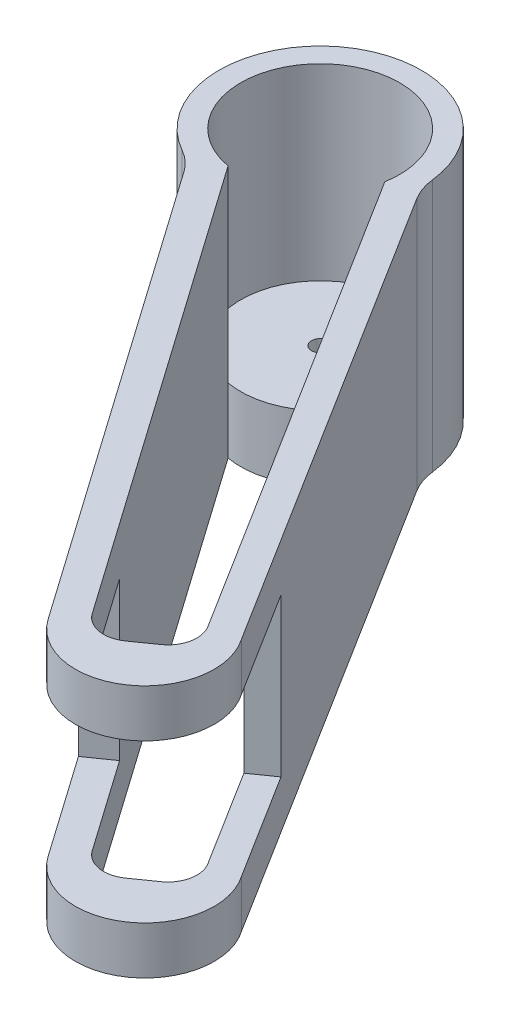
ISO-10303-21;
HEADER;
FILE_DESCRIPTION(('STEP AP214'),'2;1');
FILE_NAME('part.step','',(''),(''),'','','');
FILE_SCHEMA(('AUTOMOTIVE_DESIGN { 1 0 10303 214 1 1 1 1 }'));
ENDSEC;
DATA;
#1=APPLICATION_CONTEXT('core data for automotive mechanical design processes');
#2=APPLICATION_PROTOCOL_DEFINITION('international standard','automotive_design',2000,#1);
#3=PRODUCT_CONTEXT('',#1,'mechanical');
#4=PRODUCT('Part','Part','',(#3));
#5=PRODUCT_RELATED_PRODUCT_CATEGORY('part','',(#4));
#6=PRODUCT_DEFINITION_FORMATION('','',#4);
#7=PRODUCT_DEFINITION_CONTEXT('part definition',#1,'design');
#8=PRODUCT_DEFINITION('design','',#6,#7);
#9=PRODUCT_DEFINITION_SHAPE('','',#8);
#10=(LENGTH_UNIT() NAMED_UNIT(*) SI_UNIT(.MILLI.,.METRE.));
#11=(NAMED_UNIT(*) PLANE_ANGLE_UNIT() SI_UNIT($,.RADIAN.));
#12=(NAMED_UNIT(*) SI_UNIT($,.STERADIAN.) SOLID_ANGLE_UNIT());
#13=UNCERTAINTY_MEASURE_WITH_UNIT(LENGTH_MEASURE(1.E-05),#10,'distance_accuracy_value','');
#14=(GEOMETRIC_REPRESENTATION_CONTEXT(3) GLOBAL_UNCERTAINTY_ASSIGNED_CONTEXT((#13)) GLOBAL_UNIT_ASSIGNED_CONTEXT((#10,
#11,#12)) REPRESENTATION_CONTEXT('',''));
#15=CARTESIAN_POINT('',(0.,0.,0.));
#16=DIRECTION('',(0.,0.,1.));
#17=DIRECTION('',(1.,0.,0.));
#18=AXIS2_PLACEMENT_3D('',#15,#16,#17);
#19=CARTESIAN_POINT('',(60.7407268220711,44.45,91.5421301493623));
#20=DIRECTION('',(0.,-1.,0.));
#21=DIRECTION('',(0.,0.,-1.));
#22=AXIS2_PLACEMENT_3D('',#19,#20,#21);
#23=CYLINDRICAL_SURFACE('',#22,12.2007937034501);
#24=DIRECTION('',(0.,-1.,0.));
#25=VECTOR('',#24,1.);
#26=CARTESIAN_POINT('',(50.7538789821845,44.45,98.5508559406242));
#27=LINE('',#26,#25);
#28=CARTESIAN_POINT('',(50.7538789821845,44.45,98.5508559406242));
#29=VERTEX_POINT('',#28);
#30=CARTESIAN_POINT('',(50.7538789821845,36.068,98.5508559406242));
#31=VERTEX_POINT('',#30);
#32=EDGE_CURVE('E349',#29,#31,#27,.T.);
#33=ORIENTED_EDGE('',*,*,#32,.T.);
#34=CARTESIAN_POINT('',(60.7407268220711,36.068,91.5421301493623));
#35=DIRECTION('',(0.,1.,0.));
#36=DIRECTION('',(0.,0.,1.));
#37=AXIS2_PLACEMENT_3D('',#34,#35,#36);
#38=CIRCLE('',#37,12.2007937034501);
#39=CARTESIAN_POINT('',(70.7275746619577,36.068,84.5334043581003));
#40=VERTEX_POINT('',#39);
#41=EDGE_CURVE('E235',#31,#40,#38,.T.);
#42=ORIENTED_EDGE('',*,*,#41,.T.);
#43=DIRECTION('',(0.,-1.,0.));
#44=VECTOR('',#43,1.);
#45=CARTESIAN_POINT('',(70.7275746619577,44.45,84.5334043581003));
#46=LINE('',#45,#44);
#47=CARTESIAN_POINT('',(70.7275746619577,44.45,84.5334043581003));
#48=VERTEX_POINT('',#47);
#49=EDGE_CURVE('E345',#48,#40,#46,.T.);
#50=ORIENTED_EDGE('',*,*,#49,.F.);
#51=CARTESIAN_POINT('',(60.7407268220711,44.45,91.5421301493623));
#52=DIRECTION('',(0.,1.,0.));
#53=DIRECTION('',(0.,0.,1.));
#54=AXIS2_PLACEMENT_3D('',#51,#52,#53);
#55=CIRCLE('',#54,12.2007937034501);
#56=EDGE_CURVE('E314',#29,#48,#55,.T.);
#57=ORIENTED_EDGE('',*,*,#56,.F.);
#58=EDGE_LOOP('',(#33,#42,#50,#57));
#59=FACE_BOUND('',#58,.T.);
#60=ADVANCED_FACE('F32',(#59),#23,.T.);
#61=CARTESIAN_POINT('',(61.5820834142253,0.,88.3099991967454));
#62=DIRECTION('',(0.,1.,0.));
#63=DIRECTION('',(0.,0.,1.));
#64=AXIS2_PLACEMENT_3D('',#61,#62,#63);
#65=CYLINDRICAL_SURFACE('',#64,5.08);
#66=DIRECTION('',(0.,1.,0.));
#67=VECTOR('',#66,1.);
#68=CARTESIAN_POINT('',(65.887093564735,0.,85.6130958606934));
#69=LINE('',#68,#67);
#70=CARTESIAN_POINT('',(65.887093564735,36.068,85.6130958606934));
#71=VERTEX_POINT('',#70);
#72=CARTESIAN_POINT('',(65.887093564735,44.45,85.6130958606934));
#73=VERTEX_POINT('',#72);
#74=EDGE_CURVE('E279',#71,#73,#69,.T.);
#75=ORIENTED_EDGE('',*,*,#74,.F.);
#76=CARTESIAN_POINT('',(61.5820834142253,36.068,88.3099991967454));
#77=DIRECTION('',(0.,1.,0.));
#78=DIRECTION('',(0.,0.,1.));
#79=AXIS2_PLACEMENT_3D('',#76,#77,#78);
#80=CIRCLE('',#79,5.08);
#81=CARTESIAN_POINT('',(64.5005975608474,36.068,92.4679644654756));
#82=VERTEX_POINT('',#81);
#83=EDGE_CURVE('E227',#71,#82,#80,.F.);
#84=ORIENTED_EDGE('',*,*,#83,.T.);
#85=DIRECTION('',(0.,1.,0.));
#86=VECTOR('',#85,1.);
#87=CARTESIAN_POINT('',(64.5005975608474,0.,92.4679644654756));
#88=LINE('',#87,#86);
#89=CARTESIAN_POINT('',(64.5005975608474,44.45,92.4679644654756));
#90=VERTEX_POINT('',#89);
#91=EDGE_CURVE('E283',#82,#90,#88,.T.);
#92=ORIENTED_EDGE('',*,*,#91,.T.);
#93=CARTESIAN_POINT('',(61.5820834142253,44.45,88.3099991967454));
#94=DIRECTION('',(0.,1.,0.));
#95=DIRECTION('',(0.,0.,1.));
#96=AXIS2_PLACEMENT_3D('',#93,#94,#95);
#97=CIRCLE('',#96,5.08);
#98=EDGE_CURVE('E270',#90,#73,#97,.T.);
#99=ORIENTED_EDGE('',*,*,#98,.T.);
#100=EDGE_LOOP('',(#75,#84,#92,#99));
#101=FACE_BOUND('',#100,.T.);
#102=ADVANCED_FACE('F403',(#101),#65,.F.);
#103=CARTESIAN_POINT('',(64.5005975608474,0.,92.4679644654756));
#104=DIRECTION('',(0.574510658783885,0.,0.818497100143737));
#105=DIRECTION('',(0.818497100143737,0.,-0.574510658783885));
#106=AXIS2_PLACEMENT_3D('',#103,#104,#105);
#107=PLANE('',#106);
#108=ORIENTED_EDGE('',*,*,#91,.F.);
#109=DIRECTION('',(-0.818497100143737,0.,0.574510658783885));
#110=VECTOR('',#109,1.);
#111=CARTESIAN_POINT('',(64.5005975608474,36.068,92.4679644654756));
#112=LINE('',#111,#110);
#113=CARTESIAN_POINT('',(60.8378004128205,36.068,95.0389155441479));
#114=VERTEX_POINT('',#113);
#115=EDGE_CURVE('E224',#82,#114,#112,.T.);
#116=ORIENTED_EDGE('',*,*,#115,.T.);
#117=DIRECTION('',(0.,1.,0.));
#118=VECTOR('',#117,1.);
#119=CARTESIAN_POINT('',(60.8378004128205,0.,95.0389155441479));
#120=LINE('',#119,#118);
#121=CARTESIAN_POINT('',(60.8378004128205,44.45,95.0389155441479));
#122=VERTEX_POINT('',#121);
#123=EDGE_CURVE('E287',#114,#122,#120,.T.);
#124=ORIENTED_EDGE('',*,*,#123,.T.);
#125=DIRECTION('',(0.818497100143737,0.,-0.574510658783885));
#126=VECTOR('',#125,1.);
#127=CARTESIAN_POINT('',(64.5005975608474,44.45,92.4679644654756));
#128=LINE('',#127,#126);
#129=EDGE_CURVE('E267',#122,#90,#128,.T.);
#130=ORIENTED_EDGE('',*,*,#129,.T.);
#131=EDGE_LOOP('',(#108,#116,#124,#130));
#132=FACE_BOUND('',#131,.T.);
#133=ADVANCED_FACE('F400',(#132),#107,.F.);
#134=CARTESIAN_POINT('',(57.9192862661983,0.,90.8809502754177));
#135=DIRECTION('',(0.,1.,0.));
#136=DIRECTION('',(0.,0.,1.));
#137=AXIS2_PLACEMENT_3D('',#134,#135,#136);
#138=CYLINDRICAL_SURFACE('',#137,5.08);
#139=ORIENTED_EDGE('',*,*,#123,.F.);
#140=CARTESIAN_POINT('',(57.9192862661983,36.068,90.8809502754177));
#141=DIRECTION('',(0.,1.,0.));
#142=DIRECTION('',(0.,0.,1.));
#143=AXIS2_PLACEMENT_3D('',#140,#141,#142);
#144=CIRCLE('',#143,5.08);
#145=CARTESIAN_POINT('',(53.7613209974681,36.068,93.7994644220398));
#146=VERTEX_POINT('',#145);
#147=EDGE_CURVE('E221',#114,#146,#144,.F.);
#148=ORIENTED_EDGE('',*,*,#147,.T.);
#149=DIRECTION('',(0.,1.,0.));
#150=VECTOR('',#149,1.);
#151=CARTESIAN_POINT('',(53.7613209974681,0.,93.7994644220398));
#152=LINE('',#151,#150);
#153=CARTESIAN_POINT('',(53.7613209974681,44.45,93.7994644220398));
#154=VERTEX_POINT('',#153);
#155=EDGE_CURVE('E291',#146,#154,#152,.T.);
#156=ORIENTED_EDGE('',*,*,#155,.T.);
#157=CARTESIAN_POINT('',(57.9192862661983,44.45,90.8809502754177));
#158=DIRECTION('',(0.,1.,0.));
#159=DIRECTION('',(0.,0.,-1.));
#160=AXIS2_PLACEMENT_3D('',#157,#158,#159);
#161=CIRCLE('',#160,5.08);
#162=EDGE_CURVE('E264',#154,#122,#161,.T.);
#163=ORIENTED_EDGE('',*,*,#162,.T.);
#164=EDGE_LOOP('',(#139,#148,#156,#163));
#165=FACE_BOUND('',#164,.T.);
#166=ADVANCED_FACE('F394',(#165),#138,.F.);
#167=CARTESIAN_POINT('',(-13.7526976421414,44.45,24.3209150231614));
#168=DIRECTION('',(0.,-1.,0.));
#169=DIRECTION('',(0.,0.,-1.));
#170=AXIS2_PLACEMENT_3D('',#167,#168,#169);
#171=CYLINDRICAL_SURFACE('',#170,10.16);
#172=CARTESIAN_POINT('',(-13.7526976421414,0.,24.3209150231614));
#173=DIRECTION('',(0.,-1.,0.));
#174=DIRECTION('',(0.,0.,1.));
#175=AXIS2_PLACEMENT_3D('',#172,#173,#174);
#176=CIRCLE('',#175,10.16);
#177=CARTESIAN_POINT('',(-8.75171668136269,0.,15.47694592383));
#178=VERTEX_POINT('',#177);
#179=CARTESIAN_POINT('',(-5.43632278002439,0.,18.4845198041286));
#180=VERTEX_POINT('',#179);
#181=EDGE_CURVE('E304',#178,#180,#176,.T.);
#182=ORIENTED_EDGE('',*,*,#181,.T.);
#183=DIRECTION('',(0.,-1.,0.));
#184=VECTOR('',#183,1.);
#185=CARTESIAN_POINT('',(-5.43632278002439,44.45,18.4845198041286));
#186=LINE('',#185,#184);
#187=CARTESIAN_POINT('',(-5.43632278002439,44.45,18.4845198041286));
#188=VERTEX_POINT('',#187);
#189=EDGE_CURVE('E352',#188,#180,#186,.T.);
#190=ORIENTED_EDGE('',*,*,#189,.F.);
#191=CARTESIAN_POINT('',(-13.7526976421414,44.45,24.3209150231614));
#192=DIRECTION('',(0.,-1.,0.));
#193=DIRECTION('',(0.,0.,1.));
#194=AXIS2_PLACEMENT_3D('',#191,#192,#193);
#195=CIRCLE('',#194,10.16);
#196=CARTESIAN_POINT('',(-8.75171668136269,44.45,15.47694592383));
#197=VERTEX_POINT('',#196);
#198=EDGE_CURVE('E308',#197,#188,#195,.T.);
#199=ORIENTED_EDGE('',*,*,#198,.F.);
#200=DIRECTION('',(0.,-1.,0.));
#201=VECTOR('',#200,1.);
#202=CARTESIAN_POINT('',(-8.75171668136269,44.45,15.47694592383));
#203=LINE('',#202,#201);
#204=EDGE_CURVE('E322',#197,#178,#203,.T.);
#205=ORIENTED_EDGE('',*,*,#204,.T.);
#206=EDGE_LOOP('',(#182,#190,#199,#205));
#207=FACE_BOUND('',#206,.T.);
#208=ADVANCED_FACE('F34',(#207),#171,.F.);
#209=CARTESIAN_POINT('',(-5.43632278002439,44.45,18.4845198041286));
#210=DIRECTION('',(0.818540832885529,0.,-0.574448348329999));
#211=DIRECTION('',(-0.574448348329999,0.,-0.818540832885529));
#212=AXIS2_PLACEMENT_3D('',#209,#210,#211);
#213=PLANE('',#212);
#214=DIRECTION('',(0.,1.,0.));
#215=VECTOR('',#214,1.);
#216=CARTESIAN_POINT('',(38.2043696399614,44.45,80.6688551321076));
#217=LINE('',#216,#215);
#218=CARTESIAN_POINT('',(38.2043696399613,8.382,80.6688551321076));
#219=VERTEX_POINT('',#218);
#220=CARTESIAN_POINT('',(38.2043696399613,36.068,80.6688551321076));
#221=VERTEX_POINT('',#220);
#222=EDGE_CURVE('E417',#219,#221,#217,.T.);
#223=ORIENTED_EDGE('',*,*,#222,.T.);
#224=DIRECTION('',(0.574448348329999,0.,0.818540832885529));
#225=VECTOR('',#224,1.);
#226=CARTESIAN_POINT('',(-5.43632278002439,36.068,18.4845198041286));
#227=LINE('',#226,#225);
#228=EDGE_CURVE('E238',#221,#31,#227,.T.);
#229=ORIENTED_EDGE('',*,*,#228,.T.);
#230=ORIENTED_EDGE('',*,*,#32,.F.);
#231=DIRECTION('',(0.574448348329999,0.,0.818540832885529));
#232=VECTOR('',#231,1.);
#233=CARTESIAN_POINT('',(-5.43632278002439,44.45,18.4845198041286));
#234=LINE('',#233,#232);
#235=EDGE_CURVE('E311',#188,#29,#234,.T.);
#236=ORIENTED_EDGE('',*,*,#235,.F.);
#237=ORIENTED_EDGE('',*,*,#189,.T.);
#238=DIRECTION('',(0.574448348329999,0.,0.818540832885529));
#239=VECTOR('',#238,1.);
#240=CARTESIAN_POINT('',(-5.43632278002439,0.,18.4845198041286));
#241=LINE('',#240,#239);
#242=CARTESIAN_POINT('',(50.7538789821845,0.,98.5508559406242));
#243=VERTEX_POINT('',#242);
#244=EDGE_CURVE('E325',#180,#243,#241,.T.);
#245=ORIENTED_EDGE('',*,*,#244,.T.);
#246=CARTESIAN_POINT('',(50.7538789821845,8.382,98.5508559406242));
#247=VERTEX_POINT('',#246);
#248=EDGE_CURVE('E348',#247,#243,#27,.T.);
#249=ORIENTED_EDGE('',*,*,#248,.F.);
#250=DIRECTION('',(-0.574448348329999,0.,-0.818540832885529));
#251=VECTOR('',#250,1.);
#252=CARTESIAN_POINT('',(-5.43632278002439,8.382,18.4845198041286));
#253=LINE('',#252,#251);
#254=EDGE_CURVE('E218',#247,#219,#253,.T.);
#255=ORIENTED_EDGE('',*,*,#254,.T.);
#256=EDGE_LOOP('',(#223,#229,#230,#236,#237,#245,#249,#255));
#257=FACE_BOUND('',#256,.T.);
#258=ADVANCED_FACE('F416',(#257),#213,.F.);
#259=CARTESIAN_POINT('',(70.7275746619577,8.382,84.5334043581003));
#260=VERTEX_POINT('',#259);
#261=CARTESIAN_POINT('',(70.7275746619577,0.,84.5334043581003));
#262=VERTEX_POINT('',#261);
#263=EDGE_CURVE('E344',#260,#262,#46,.T.);
#264=ORIENTED_EDGE('',*,*,#263,.F.);
#265=CARTESIAN_POINT('',(60.7407268220711,8.382,91.5421301493623));
#266=DIRECTION('',(0.,-1.,0.));
#267=DIRECTION('',(0.,0.,-1.));
#268=AXIS2_PLACEMENT_3D('',#265,#266,#267);
#269=CIRCLE('',#268,12.2007937034501);
#270=EDGE_CURVE('E210',#260,#247,#269,.T.);
#271=ORIENTED_EDGE('',*,*,#270,.T.);
#272=ORIENTED_EDGE('',*,*,#248,.T.);
#273=CARTESIAN_POINT('',(60.7407268220711,0.,91.5421301493623));
#274=DIRECTION('',(0.,1.,0.));
#275=DIRECTION('',(0.,0.,1.));
#276=AXIS2_PLACEMENT_3D('',#273,#274,#275);
#277=CIRCLE('',#276,12.2007937034501);
#278=EDGE_CURVE('E328',#243,#262,#277,.T.);
#279=ORIENTED_EDGE('',*,*,#278,.T.);
#280=EDGE_LOOP('',(#264,#271,#272,#279));
#281=FACE_BOUND('',#280,.T.);
#282=ADVANCED_FACE('F439',(#281),#23,.T.);
#283=CARTESIAN_POINT('',(19.1439114721388,44.45,2.1775516767116));
#284=DIRECTION('',(-0.847483354744128,0.,0.53082196962036));
#285=DIRECTION('',(0.53082196962036,0.,0.847483354744128));
#286=AXIS2_PLACEMENT_3D('',#283,#284,#285);
#287=PLANE('',#286);
#288=ORIENTED_EDGE('',*,*,#49,.T.);
#289=DIRECTION('',(-0.53082196962036,0.,-0.847483354744128));
#290=VECTOR('',#289,1.);
#291=CARTESIAN_POINT('',(19.1439114721388,36.068,2.1775516767116));
#292=LINE('',#291,#290);
#293=CARTESIAN_POINT('',(59.1141875349744,36.068,65.9920612231183));
#294=VERTEX_POINT('',#293);
#295=EDGE_CURVE('E232',#40,#294,#292,.T.);
#296=ORIENTED_EDGE('',*,*,#295,.T.);
#297=DIRECTION('',(0.,-1.,0.));
#298=VECTOR('',#297,1.);
#299=CARTESIAN_POINT('',(59.1141875349744,44.45,65.9920612231183));
#300=LINE('',#299,#298);
#301=CARTESIAN_POINT('',(59.1141875349744,8.382,65.9920612231183));
#302=VERTEX_POINT('',#301);
#303=EDGE_CURVE('E193',#294,#302,#300,.T.);
#304=ORIENTED_EDGE('',*,*,#303,.T.);
#305=DIRECTION('',(0.53082196962036,0.,0.847483354744128));
#306=VECTOR('',#305,1.);
#307=CARTESIAN_POINT('',(19.1439114721388,8.382,2.1775516767116));
#308=LINE('',#307,#306);
#309=EDGE_CURVE('E201',#302,#260,#308,.T.);
#310=ORIENTED_EDGE('',*,*,#309,.T.);
#311=ORIENTED_EDGE('',*,*,#263,.T.);
#312=DIRECTION('',(-0.53082196962036,0.,-0.847483354744128));
#313=VECTOR('',#312,1.);
#314=CARTESIAN_POINT('',(19.1439114721388,0.,2.1775516767116));
#315=LINE('',#314,#313);
#316=CARTESIAN_POINT('',(19.1439114721388,0.,2.1775516767116));
#317=VERTEX_POINT('',#316);
#318=EDGE_CURVE('E331',#262,#317,#315,.T.);
#319=ORIENTED_EDGE('',*,*,#318,.T.);
#320=DIRECTION('',(0.,-1.,0.));
#321=VECTOR('',#320,1.);
#322=CARTESIAN_POINT('',(19.1439114721388,44.45,2.1775516767116));
#323=LINE('',#322,#321);
#324=CARTESIAN_POINT('',(19.1439114721388,44.45,2.1775516767116));
#325=VERTEX_POINT('',#324);
#326=EDGE_CURVE('E341',#325,#317,#323,.T.);
#327=ORIENTED_EDGE('',*,*,#326,.F.);
#328=DIRECTION('',(-0.53082196962036,0.,-0.847483354744128));
#329=VECTOR('',#328,1.);
#330=CARTESIAN_POINT('',(19.1439114721388,44.45,2.1775516767116));
#331=LINE('',#330,#329);
#332=EDGE_CURVE('E316',#48,#325,#331,.T.);
#333=ORIENTED_EDGE('',*,*,#332,.F.);
#334=EDGE_LOOP('',(#288,#296,#304,#310,#311,#319,#327,#333));
#335=FACE_BOUND('',#334,.T.);
#336=ADVANCED_FACE('F406',(#335),#287,.F.);
#337=CARTESIAN_POINT('',(27.7543423563391,44.45,-3.21559953463126));
#338=DIRECTION('',(0.,-1.,0.));
#339=DIRECTION('',(0.,0.,-1.));
#340=AXIS2_PLACEMENT_3D('',#337,#338,#339);
#341=CYLINDRICAL_SURFACE('',#340,10.16);
#342=CARTESIAN_POINT('',(27.7543423563391,0.,-3.21559953463126));
#343=DIRECTION('',(0.,-1.,0.));
#344=DIRECTION('',(0.,0.,-1.));
#345=AXIS2_PLACEMENT_3D('',#342,#343,#344);
#346=CIRCLE('',#345,10.16);
#347=CARTESIAN_POINT('',(17.6618542267612,0.,-2.04629061294716));
#348=VERTEX_POINT('',#347);
#349=EDGE_CURVE('E333',#317,#348,#346,.T.);
#350=ORIENTED_EDGE('',*,*,#349,.T.);
#351=DIRECTION('',(0.,-1.,0.));
#352=VECTOR('',#351,1.);
#353=CARTESIAN_POINT('',(17.6618542267612,44.45,-2.04629061294716));
#354=LINE('',#353,#352);
#355=CARTESIAN_POINT('',(17.6618542267612,44.45,-2.04629061294716));
#356=VERTEX_POINT('',#355);
#357=EDGE_CURVE('E338',#356,#348,#354,.T.);
#358=ORIENTED_EDGE('',*,*,#357,.F.);
#359=CARTESIAN_POINT('',(27.7543423563391,44.45,-3.21559953463126));
#360=DIRECTION('',(0.,-1.,0.));
#361=DIRECTION('',(0.,0.,-1.));
#362=AXIS2_PLACEMENT_3D('',#359,#360,#361);
#363=CIRCLE('',#362,10.16);
#364=EDGE_CURVE('E318',#325,#356,#363,.T.);
#365=ORIENTED_EDGE('',*,*,#364,.F.);
#366=ORIENTED_EDGE('',*,*,#326,.T.);
#367=EDGE_LOOP('',(#350,#358,#365,#366));
#368=FACE_BOUND('',#367,.T.);
#369=ADVANCED_FACE('F449',(#368),#341,.F.);
#370=CARTESIAN_POINT('',(0.,44.45,0.));
#371=DIRECTION('',(0.,-1.,0.));
#372=DIRECTION('',(0.,0.,-1.));
#373=AXIS2_PLACEMENT_3D('',#370,#371,#372);
#374=CYLINDRICAL_SURFACE('',#373,17.78);
#375=CARTESIAN_POINT('',(0.,0.,0.));
#376=DIRECTION('',(0.,1.,0.));
#377=DIRECTION('',(0.,0.,1.));
#378=AXIS2_PLACEMENT_3D('',#375,#376,#377);
#379=CIRCLE('',#378,17.78);
#380=EDGE_CURVE('E312',#348,#178,#379,.T.);
#381=ORIENTED_EDGE('',*,*,#380,.T.);
#382=ORIENTED_EDGE('',*,*,#204,.F.);
#383=CARTESIAN_POINT('',(0.,44.45,0.));
#384=DIRECTION('',(0.,1.,0.));
#385=DIRECTION('',(0.,0.,1.));
#386=AXIS2_PLACEMENT_3D('',#383,#384,#385);
#387=CIRCLE('',#386,17.78);
#388=EDGE_CURVE('E320',#356,#197,#387,.T.);
#389=ORIENTED_EDGE('',*,*,#388,.F.);
#390=ORIENTED_EDGE('',*,*,#357,.T.);
#391=EDGE_LOOP('',(#381,#382,#389,#390));
#392=FACE_BOUND('',#391,.T.);
#393=ADVANCED_FACE('F462',(#392),#374,.T.);
#394=CARTESIAN_POINT('',(-13.7526976421414,44.45,24.3209150231614));
#395=DIRECTION('',(0.,1.,0.));
#396=DIRECTION('',(0.,0.,1.));
#397=AXIS2_PLACEMENT_3D('',#394,#395,#396);
#398=PLANE('',#397);
#399=DIRECTION('',(-0.530886483474794,0.,-0.847442943013727));
#400=VECTOR('',#399,1.);
#401=CARTESIAN_POINT('',(13.7612918752992,44.45,2.40577345625571));
#402=LINE('',#401,#400);
#403=CARTESIAN_POINT('',(13.7612918752992,44.45,2.40577345625571));
#404=VERTEX_POINT('',#403);
#405=EDGE_CURVE('E246',#73,#404,#402,.T.);
#406=ORIENTED_EDGE('',*,*,#405,.F.);
#407=ORIENTED_EDGE('',*,*,#98,.F.);
#408=ORIENTED_EDGE('',*,*,#129,.F.);
#409=ORIENTED_EDGE('',*,*,#162,.F.);
#410=DIRECTION('',(0.574510658783884,0.,0.818497100143738));
#411=VECTOR('',#410,1.);
#412=CARTESIAN_POINT('',(-2.41995559923247,44.45,13.7588049952655));
#413=LINE('',#412,#411);
#414=CARTESIAN_POINT('',(-2.41995559923247,44.45,13.7588049952655));
#415=VERTEX_POINT('',#414);
#416=EDGE_CURVE('E241',#415,#154,#413,.T.);
#417=ORIENTED_EDGE('',*,*,#416,.F.);
#418=CARTESIAN_POINT('',(0.,44.45,0.));
#419=DIRECTION('',(0.,1.,0.));
#420=DIRECTION('',(0.,0.,1.));
#421=AXIS2_PLACEMENT_3D('',#418,#419,#420);
#422=CIRCLE('',#421,13.97);
#423=EDGE_CURVE('E298',#404,#415,#422,.T.);
#424=ORIENTED_EDGE('',*,*,#423,.F.);
#425=EDGE_LOOP('',(#406,#407,#408,#409,#417,#424));
#426=FACE_BOUND('',#425,.T.);
#427=ORIENTED_EDGE('',*,*,#198,.T.);
#428=ORIENTED_EDGE('',*,*,#235,.T.);
#429=ORIENTED_EDGE('',*,*,#56,.T.);
#430=ORIENTED_EDGE('',*,*,#332,.T.);
#431=ORIENTED_EDGE('',*,*,#364,.T.);
#432=ORIENTED_EDGE('',*,*,#388,.T.);
#433=EDGE_LOOP('',(#427,#428,#429,#430,#431,#432));
#434=FACE_BOUND('',#433,.T.);
#435=ADVANCED_FACE('F387',(#426,#434),#398,.T.);
#436=CARTESIAN_POINT('',(-13.7526976421414,0.,24.3209150231614));
#437=DIRECTION('',(0.,1.,0.));
#438=DIRECTION('',(0.,0.,1.));
#439=AXIS2_PLACEMENT_3D('',#436,#437,#438);
#440=PLANE('',#439);
#441=DIRECTION('',(-0.530886483474794,0.,-0.847442943013727));
#442=VECTOR('',#441,1.);
#443=CARTESIAN_POINT('',(13.7612918752992,0.,2.40577345625571));
#444=LINE('',#443,#442);
#445=CARTESIAN_POINT('',(65.887093564735,0.,85.6130958606934));
#446=VERTEX_POINT('',#445);
#447=CARTESIAN_POINT('',(13.7612918752992,0.,2.40577345625571));
#448=VERTEX_POINT('',#447);
#449=EDGE_CURVE('E258',#446,#448,#444,.T.);
#450=ORIENTED_EDGE('',*,*,#449,.T.);
#451=CARTESIAN_POINT('',(0.,0.,0.));
#452=DIRECTION('',(0.,-1.,0.));
#453=DIRECTION('',(0.,0.,1.));
#454=AXIS2_PLACEMENT_3D('',#451,#452,#453);
#455=CIRCLE('',#454,13.97);
#456=CARTESIAN_POINT('',(-2.41995559923247,0.,13.7588049952655));
#457=VERTEX_POINT('',#456);
#458=EDGE_CURVE('E242',#448,#457,#455,.T.);
#459=ORIENTED_EDGE('',*,*,#458,.T.);
#460=DIRECTION('',(0.574510658783884,0.,0.818497100143738));
#461=VECTOR('',#460,1.);
#462=CARTESIAN_POINT('',(-2.41995559923247,0.,13.7588049952655));
#463=LINE('',#462,#461);
#464=CARTESIAN_POINT('',(53.7613209974681,0.,93.7994644220398));
#465=VERTEX_POINT('',#464);
#466=EDGE_CURVE('E245',#457,#465,#463,.T.);
#467=ORIENTED_EDGE('',*,*,#466,.T.);
#468=CARTESIAN_POINT('',(57.9192862661983,0.,90.8809502754177));
#469=DIRECTION('',(0.,1.,0.));
#470=DIRECTION('',(0.,0.,-1.));
#471=AXIS2_PLACEMENT_3D('',#468,#469,#470);
#472=CIRCLE('',#471,5.08);
#473=CARTESIAN_POINT('',(60.8378004128205,0.,95.0389155441479));
#474=VERTEX_POINT('',#473);
#475=EDGE_CURVE('E249',#465,#474,#472,.T.);
#476=ORIENTED_EDGE('',*,*,#475,.T.);
#477=DIRECTION('',(0.818497100143737,0.,-0.574510658783885));
#478=VECTOR('',#477,1.);
#479=CARTESIAN_POINT('',(64.5005975608474,0.,92.4679644654756));
#480=LINE('',#479,#478);
#481=CARTESIAN_POINT('',(64.5005975608474,0.,92.4679644654756));
#482=VERTEX_POINT('',#481);
#483=EDGE_CURVE('E252',#474,#482,#480,.T.);
#484=ORIENTED_EDGE('',*,*,#483,.T.);
#485=CARTESIAN_POINT('',(61.5820834142253,0.,88.3099991967454));
#486=DIRECTION('',(0.,1.,0.));
#487=DIRECTION('',(0.,0.,1.));
#488=AXIS2_PLACEMENT_3D('',#485,#486,#487);
#489=CIRCLE('',#488,5.08);
#490=EDGE_CURVE('E255',#482,#446,#489,.T.);
#491=ORIENTED_EDGE('',*,*,#490,.T.);
#492=EDGE_LOOP('',(#450,#459,#467,#476,#484,#491));
#493=FACE_BOUND('',#492,.T.);
#494=CARTESIAN_POINT('',(0.,0.,0.));
#495=DIRECTION('',(0.,-1.,0.));
#496=DIRECTION('',(0.,0.,-1.));
#497=AXIS2_PLACEMENT_3D('',#494,#495,#496);
#498=CIRCLE('',#497,1.524);
#499=CARTESIAN_POINT('',(0.,0.,-1.524));
#500=VERTEX_POINT('',#499);
#501=EDGE_CURVE('E276',#500,#500,#498,.T.);
#502=ORIENTED_EDGE('',*,*,#501,.F.);
#503=EDGE_LOOP('',(#502));
#504=FACE_BOUND('',#503,.T.);
#505=ORIENTED_EDGE('',*,*,#181,.F.);
#506=ORIENTED_EDGE('',*,*,#380,.F.);
#507=ORIENTED_EDGE('',*,*,#349,.F.);
#508=ORIENTED_EDGE('',*,*,#318,.F.);
#509=ORIENTED_EDGE('',*,*,#278,.F.);
#510=ORIENTED_EDGE('',*,*,#244,.F.);
#511=EDGE_LOOP('',(#505,#506,#507,#508,#509,#510));
#512=FACE_BOUND('',#511,.T.);
#513=ADVANCED_FACE('F369',(#493,#504,#512),#440,.F.);
#514=CARTESIAN_POINT('',(0.,11.43,0.));
#515=DIRECTION('',(0.,1.,0.));
#516=DIRECTION('',(0.,0.,1.));
#517=AXIS2_PLACEMENT_3D('',#514,#515,#516);
#518=CYLINDRICAL_SURFACE('',#517,13.97);
#519=CARTESIAN_POINT('',(0.,11.43,0.));
#520=DIRECTION('',(0.,1.,0.));
#521=DIRECTION('',(0.,0.,1.));
#522=AXIS2_PLACEMENT_3D('',#519,#520,#521);
#523=CIRCLE('',#522,13.97);
#524=CARTESIAN_POINT('',(13.7612918752992,11.43,2.4057734562557));
#525=VERTEX_POINT('',#524);
#526=CARTESIAN_POINT('',(-2.41995559923247,11.43,13.7588049952655));
#527=VERTEX_POINT('',#526);
#528=EDGE_CURVE('E301',#525,#527,#523,.T.);
#529=ORIENTED_EDGE('',*,*,#528,.F.);
#530=DIRECTION('',(0.,1.,0.));
#531=VECTOR('',#530,1.);
#532=CARTESIAN_POINT('',(13.7612918752992,0.,2.40577345625571));
#533=LINE('',#532,#531);
#534=EDGE_CURVE('E277',#525,#404,#533,.T.);
#535=ORIENTED_EDGE('',*,*,#534,.T.);
#536=ORIENTED_EDGE('',*,*,#423,.T.);
#537=DIRECTION('',(0.,1.,0.));
#538=VECTOR('',#537,1.);
#539=CARTESIAN_POINT('',(-2.41995559923247,0.,13.7588049952655));
#540=LINE('',#539,#538);
#541=EDGE_CURVE('E261',#527,#415,#540,.T.);
#542=ORIENTED_EDGE('',*,*,#541,.F.);
#543=EDGE_LOOP('',(#529,#535,#536,#542));
#544=FACE_BOUND('',#543,.T.);
#545=ADVANCED_FACE('F377',(#544),#518,.F.);
#546=CARTESIAN_POINT('',(0.,11.43,0.));
#547=DIRECTION('',(0.,1.,0.));
#548=DIRECTION('',(0.,0.,1.));
#549=AXIS2_PLACEMENT_3D('',#546,#547,#548);
#550=PLANE('',#549);
#551=CARTESIAN_POINT('',(0.,11.43,0.));
#552=DIRECTION('',(0.,-1.,0.));
#553=DIRECTION('',(0.,0.,-1.));
#554=AXIS2_PLACEMENT_3D('',#551,#552,#553);
#555=CIRCLE('',#554,1.524);
#556=CARTESIAN_POINT('',(0.,11.43,-1.524));
#557=VERTEX_POINT('',#556);
#558=EDGE_CURVE('E295',#557,#557,#555,.T.);
#559=ORIENTED_EDGE('',*,*,#558,.T.);
#560=EDGE_LOOP('',(#559));
#561=FACE_BOUND('',#560,.T.);
#562=ORIENTED_EDGE('',*,*,#528,.T.);
#563=EDGE_CURVE('E305',#527,#525,#523,.T.);
#564=ORIENTED_EDGE('',*,*,#563,.T.);
#565=EDGE_LOOP('',(#562,#564));
#566=FACE_BOUND('',#565,.T.);
#567=ADVANCED_FACE('F382',(#561,#566),#550,.T.);
#568=CARTESIAN_POINT('',(0.,11.43,0.));
#569=DIRECTION('',(0.,-1.,0.));
#570=DIRECTION('',(0.,0.,-1.));
#571=AXIS2_PLACEMENT_3D('',#568,#569,#570);
#572=CYLINDRICAL_SURFACE('',#571,1.524);
#573=ORIENTED_EDGE('',*,*,#558,.F.);
#574=EDGE_LOOP('',(#573));
#575=FACE_BOUND('',#574,.T.);
#576=ORIENTED_EDGE('',*,*,#501,.T.);
#577=EDGE_LOOP('',(#576));
#578=FACE_BOUND('',#577,.T.);
#579=ADVANCED_FACE('F494',(#575,#578),#572,.F.);
#580=CARTESIAN_POINT('',(0.,0.,0.));
#581=DIRECTION('',(0.,1.,0.));
#582=DIRECTION('',(0.,0.,1.));
#583=AXIS2_PLACEMENT_3D('',#580,#581,#582);
#584=CYLINDRICAL_SURFACE('',#583,13.97);
#585=ORIENTED_EDGE('',*,*,#563,.F.);
#586=EDGE_CURVE('E292',#457,#527,#540,.T.);
#587=ORIENTED_EDGE('',*,*,#586,.F.);
#588=ORIENTED_EDGE('',*,*,#458,.F.);
#589=EDGE_CURVE('E274',#448,#525,#533,.T.);
#590=ORIENTED_EDGE('',*,*,#589,.T.);
#591=EDGE_LOOP('',(#585,#587,#588,#590));
#592=FACE_BOUND('',#591,.T.);
#593=ADVANCED_FACE('F383',(#592),#584,.T.);
#594=CARTESIAN_POINT('',(13.7612918752992,0.,2.40577345625571));
#595=DIRECTION('',(0.847442943013727,0.,-0.530886483474794));
#596=DIRECTION('',(-0.530886483474794,0.,-0.847442943013727));
#597=AXIS2_PLACEMENT_3D('',#594,#595,#596);
#598=PLANE('',#597);
#599=DIRECTION('',(0.,1.,0.));
#600=VECTOR('',#599,1.);
#601=CARTESIAN_POINT('',(55.2809127203126,0.,68.6826721473162));
#602=LINE('',#601,#600);
#603=CARTESIAN_POINT('',(55.2809127203126,8.382,68.6826721473162));
#604=VERTEX_POINT('',#603);
#605=CARTESIAN_POINT('',(55.2809127203126,36.068,68.6826721473162));
#606=VERTEX_POINT('',#605);
#607=EDGE_CURVE('E186',#604,#606,#602,.T.);
#608=ORIENTED_EDGE('',*,*,#607,.T.);
#609=DIRECTION('',(0.530886483474794,0.,0.847442943013727));
#610=VECTOR('',#609,1.);
#611=CARTESIAN_POINT('',(13.7612918752992,36.068,2.40577345625571));
#612=LINE('',#611,#610);
#613=EDGE_CURVE('E230',#606,#71,#612,.T.);
#614=ORIENTED_EDGE('',*,*,#613,.T.);
#615=ORIENTED_EDGE('',*,*,#74,.T.);
#616=ORIENTED_EDGE('',*,*,#405,.T.);
#617=ORIENTED_EDGE('',*,*,#534,.F.);
#618=ORIENTED_EDGE('',*,*,#589,.F.);
#619=ORIENTED_EDGE('',*,*,#449,.F.);
#620=CARTESIAN_POINT('',(65.887093564735,8.382,85.6130958606934));
#621=VERTEX_POINT('',#620);
#622=EDGE_CURVE('E207',#446,#621,#69,.T.);
#623=ORIENTED_EDGE('',*,*,#622,.T.);
#624=DIRECTION('',(-0.530886483474794,0.,-0.847442943013727));
#625=VECTOR('',#624,1.);
#626=CARTESIAN_POINT('',(13.7612918752992,8.382,2.40577345625571));
#627=LINE('',#626,#625);
#628=EDGE_CURVE('E198',#621,#604,#627,.T.);
#629=ORIENTED_EDGE('',*,*,#628,.T.);
#630=EDGE_LOOP('',(#608,#614,#615,#616,#617,#618,#619,#623,#629));
#631=FACE_BOUND('',#630,.T.);
#632=ADVANCED_FACE('F205',(#631),#598,.F.);
#633=CARTESIAN_POINT('',(64.5005975608474,8.382,92.4679644654756));
#634=VERTEX_POINT('',#633);
#635=EDGE_CURVE('E280',#482,#634,#88,.T.);
#636=ORIENTED_EDGE('',*,*,#635,.T.);
#637=CARTESIAN_POINT('',(61.5820834142253,8.382,88.3099991967454));
#638=DIRECTION('',(0.,-1.,0.));
#639=DIRECTION('',(0.,0.,-1.));
#640=AXIS2_PLACEMENT_3D('',#637,#638,#639);
#641=CIRCLE('',#640,5.08);
#642=EDGE_CURVE('E208',#634,#621,#641,.F.);
#643=ORIENTED_EDGE('',*,*,#642,.T.);
#644=ORIENTED_EDGE('',*,*,#622,.F.);
#645=ORIENTED_EDGE('',*,*,#490,.F.);
#646=EDGE_LOOP('',(#636,#643,#644,#645));
#647=FACE_BOUND('',#646,.T.);
#648=ADVANCED_FACE('F427',(#647),#65,.F.);
#649=CARTESIAN_POINT('',(60.8378004128205,8.382,95.0389155441479));
#650=VERTEX_POINT('',#649);
#651=EDGE_CURVE('E284',#474,#650,#120,.T.);
#652=ORIENTED_EDGE('',*,*,#651,.T.);
#653=DIRECTION('',(0.818497100143737,0.,-0.574510658783885));
#654=VECTOR('',#653,1.);
#655=CARTESIAN_POINT('',(64.5005975608474,8.382,92.4679644654756));
#656=LINE('',#655,#654);
#657=EDGE_CURVE('E212',#650,#634,#656,.T.);
#658=ORIENTED_EDGE('',*,*,#657,.T.);
#659=ORIENTED_EDGE('',*,*,#635,.F.);
#660=ORIENTED_EDGE('',*,*,#483,.F.);
#661=EDGE_LOOP('',(#652,#658,#659,#660));
#662=FACE_BOUND('',#661,.T.);
#663=ADVANCED_FACE('F424',(#662),#107,.F.);
#664=CARTESIAN_POINT('',(53.7613209974681,8.382,93.7994644220398));
#665=VERTEX_POINT('',#664);
#666=EDGE_CURVE('E288',#465,#665,#152,.T.);
#667=ORIENTED_EDGE('',*,*,#666,.T.);
#668=CARTESIAN_POINT('',(57.9192862661983,8.382,90.8809502754177));
#669=DIRECTION('',(0.,-1.,0.));
#670=DIRECTION('',(0.,0.,-1.));
#671=AXIS2_PLACEMENT_3D('',#668,#669,#670);
#672=CIRCLE('',#671,5.08);
#673=EDGE_CURVE('E366',#665,#650,#672,.F.);
#674=ORIENTED_EDGE('',*,*,#673,.T.);
#675=ORIENTED_EDGE('',*,*,#651,.F.);
#676=ORIENTED_EDGE('',*,*,#475,.F.);
#677=EDGE_LOOP('',(#667,#674,#675,#676));
#678=FACE_BOUND('',#677,.T.);
#679=ADVANCED_FACE('F365',(#678),#138,.F.);
#680=CARTESIAN_POINT('',(-2.41995559923247,0.,13.7588049952655));
#681=DIRECTION('',(-0.818497100143737,0.,0.574510658783884));
#682=DIRECTION('',(0.574510658783884,0.,0.818497100143738));
#683=AXIS2_PLACEMENT_3D('',#680,#681,#682);
#684=PLANE('',#683);
#685=ORIENTED_EDGE('',*,*,#155,.F.);
#686=DIRECTION('',(-0.574510658783884,0.,-0.818497100143738));
#687=VECTOR('',#686,1.);
#688=CARTESIAN_POINT('',(-2.41995559923247,36.068,13.7588049952655));
#689=LINE('',#688,#687);
#690=CARTESIAN_POINT('',(42.4520786793073,36.068,77.6873490057104));
#691=VERTEX_POINT('',#690);
#692=EDGE_CURVE('E11',#146,#691,#689,.T.);
#693=ORIENTED_EDGE('',*,*,#692,.T.);
#694=DIRECTION('',(0.,-1.,0.));
#695=VECTOR('',#694,1.);
#696=CARTESIAN_POINT('',(42.4520786793073,0.,77.6873490057104));
#697=LINE('',#696,#695);
#698=CARTESIAN_POINT('',(42.4520786793073,8.382,77.6873490057104));
#699=VERTEX_POINT('',#698);
#700=EDGE_CURVE('E355',#691,#699,#697,.T.);
#701=ORIENTED_EDGE('',*,*,#700,.T.);
#702=DIRECTION('',(0.574510658783884,0.,0.818497100143738));
#703=VECTOR('',#702,1.);
#704=CARTESIAN_POINT('',(-2.41995559923247,8.382,13.7588049952655));
#705=LINE('',#704,#703);
#706=EDGE_CURVE('E40',#699,#665,#705,.T.);
#707=ORIENTED_EDGE('',*,*,#706,.T.);
#708=ORIENTED_EDGE('',*,*,#666,.F.);
#709=ORIENTED_EDGE('',*,*,#466,.F.);
#710=ORIENTED_EDGE('',*,*,#586,.T.);
#711=ORIENTED_EDGE('',*,*,#541,.T.);
#712=ORIENTED_EDGE('',*,*,#416,.T.);
#713=EDGE_LOOP('',(#685,#693,#701,#707,#708,#709,#710,#711,#712));
#714=FACE_BOUND('',#713,.T.);
#715=ADVANCED_FACE('F361',(#714),#684,.F.);
#716=CARTESIAN_POINT('',(93.2924760660296,36.068,96.3088564024294));
#717=DIRECTION('',(0.,1.,0.));
#718=DIRECTION('',(0.,0.,1.));
#719=AXIS2_PLACEMENT_3D('',#716,#717,#718);
#720=PLANE('',#719);
#721=DIRECTION('',(0.818497100143737,0.,-0.574510658783885));
#722=VECTOR('',#721,1.);
#723=CARTESIAN_POINT('',(67.755477283086,36.068,59.9266603010403));
#724=LINE('',#723,#722);
#725=EDGE_CURVE('E194',#221,#691,#724,.T.);
#726=ORIENTED_EDGE('',*,*,#725,.T.);
#727=ORIENTED_EDGE('',*,*,#692,.F.);
#728=ORIENTED_EDGE('',*,*,#147,.F.);
#729=ORIENTED_EDGE('',*,*,#115,.F.);
#730=ORIENTED_EDGE('',*,*,#83,.F.);
#731=ORIENTED_EDGE('',*,*,#613,.F.);
#732=EDGE_CURVE('E189',#606,#294,#724,.T.);
#733=ORIENTED_EDGE('',*,*,#732,.T.);
#734=ORIENTED_EDGE('',*,*,#295,.F.);
#735=ORIENTED_EDGE('',*,*,#41,.F.);
#736=ORIENTED_EDGE('',*,*,#228,.F.);
#737=EDGE_LOOP('',(#726,#727,#728,#729,#730,#731,#733,#734,#735,#736));
#738=FACE_BOUND('',#737,.T.);
#739=ADVANCED_FACE('F397',(#738),#720,.F.);
#740=CARTESIAN_POINT('',(93.2924760660296,8.382,96.3088564024294));
#741=DIRECTION('',(0.,-1.,0.));
#742=DIRECTION('',(0.,0.,-1.));
#743=AXIS2_PLACEMENT_3D('',#740,#741,#742);
#744=PLANE('',#743);
#745=ORIENTED_EDGE('',*,*,#270,.F.);
#746=ORIENTED_EDGE('',*,*,#309,.F.);
#747=DIRECTION('',(-0.818497100143737,0.,0.574510658783885));
#748=VECTOR('',#747,1.);
#749=CARTESIAN_POINT('',(67.755477283086,8.382,59.9266603010403));
#750=LINE('',#749,#748);
#751=EDGE_CURVE('E47',#302,#604,#750,.T.);
#752=ORIENTED_EDGE('',*,*,#751,.T.);
#753=ORIENTED_EDGE('',*,*,#628,.F.);
#754=ORIENTED_EDGE('',*,*,#642,.F.);
#755=ORIENTED_EDGE('',*,*,#657,.F.);
#756=ORIENTED_EDGE('',*,*,#673,.F.);
#757=ORIENTED_EDGE('',*,*,#706,.F.);
#758=EDGE_CURVE('E55',#699,#219,#750,.T.);
#759=ORIENTED_EDGE('',*,*,#758,.T.);
#760=ORIENTED_EDGE('',*,*,#254,.F.);
#761=EDGE_LOOP('',(#745,#746,#752,#753,#754,#755,#756,#757,#759,#760));
#762=FACE_BOUND('',#761,.T.);
#763=ADVANCED_FACE('F197',(#762),#744,.F.);
#764=CARTESIAN_POINT('',(50.5431735983282,0.,72.0081349053876));
#765=DIRECTION('',(-0.574510658783885,0.,-0.818497100143737));
#766=DIRECTION('',(-0.818497100143737,0.,0.574510658783885));
#767=AXIS2_PLACEMENT_3D('',#764,#765,#766);
#768=PLANE('',#767);
#769=ORIENTED_EDGE('',*,*,#758,.F.);
#770=ORIENTED_EDGE('',*,*,#700,.F.);
#771=ORIENTED_EDGE('',*,*,#725,.F.);
#772=ORIENTED_EDGE('',*,*,#222,.F.);
#773=EDGE_LOOP('',(#769,#770,#771,#772));
#774=FACE_BOUND('',#773,.T.);
#775=ADVANCED_FACE('F620',(#774),#768,.F.);
#776=ORIENTED_EDGE('',*,*,#732,.F.);
#777=ORIENTED_EDGE('',*,*,#607,.F.);
#778=ORIENTED_EDGE('',*,*,#751,.F.);
#779=ORIENTED_EDGE('',*,*,#303,.F.);
#780=EDGE_LOOP('',(#776,#777,#778,#779));
#781=FACE_BOUND('',#780,.T.);
#782=ADVANCED_FACE('F187',(#781),#768,.F.);
#783=CLOSED_SHELL('',(#60,#102,#133,#166,#208,#258,#282,#336,#369,#393,#435,#513,#545,#567,#579,
#593,#632,#648,#663,#679,#715,#739,#763,#775,#782));
#784=MANIFOLD_SOLID_BREP('B2',#783);
#785=ADVANCED_BREP_SHAPE_REPRESENTATION('',(#18,#784),#14);
#786=SHAPE_DEFINITION_REPRESENTATION(#9,#785);
ENDSEC;
END-ISO-10303-21;
